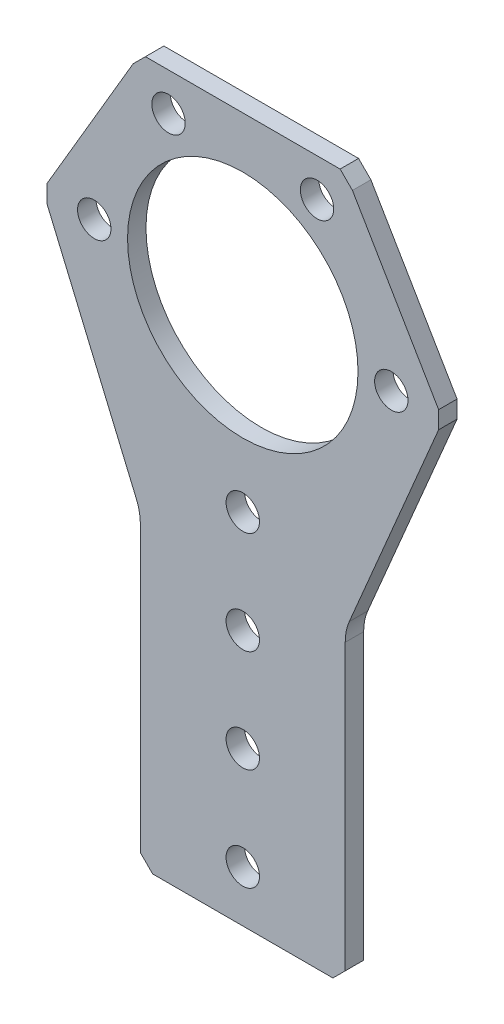
ISO-10303-21;
HEADER;
FILE_DESCRIPTION(('STEP AP214'),'2;1');
FILE_NAME('part.step','',(''),(''),'','','');
FILE_SCHEMA(('AUTOMOTIVE_DESIGN { 1 0 10303 214 1 1 1 1 }'));
ENDSEC;
DATA;
#1=APPLICATION_CONTEXT('core data for automotive mechanical design processes');
#2=APPLICATION_PROTOCOL_DEFINITION('international standard','automotive_design',2000,#1);
#3=PRODUCT_CONTEXT('',#1,'mechanical');
#4=PRODUCT('Part','Part','',(#3));
#5=PRODUCT_RELATED_PRODUCT_CATEGORY('part','',(#4));
#6=PRODUCT_DEFINITION_FORMATION('','',#4);
#7=PRODUCT_DEFINITION_CONTEXT('part definition',#1,'design');
#8=PRODUCT_DEFINITION('design','',#6,#7);
#9=PRODUCT_DEFINITION_SHAPE('','',#8);
#10=(LENGTH_UNIT() NAMED_UNIT(*) SI_UNIT(.MILLI.,.METRE.));
#11=(NAMED_UNIT(*) PLANE_ANGLE_UNIT() SI_UNIT($,.RADIAN.));
#12=(NAMED_UNIT(*) SI_UNIT($,.STERADIAN.) SOLID_ANGLE_UNIT());
#13=UNCERTAINTY_MEASURE_WITH_UNIT(LENGTH_MEASURE(1.E-05),#10,'distance_accuracy_value','');
#14=(GEOMETRIC_REPRESENTATION_CONTEXT(3) GLOBAL_UNCERTAINTY_ASSIGNED_CONTEXT((#13)) GLOBAL_UNIT_ASSIGNED_CONTEXT((#10,
#11,#12)) REPRESENTATION_CONTEXT('',''));
#15=CARTESIAN_POINT('',(0.,0.,0.));
#16=DIRECTION('',(0.,0.,1.));
#17=DIRECTION('',(1.,0.,0.));
#18=AXIS2_PLACEMENT_3D('',#15,#16,#17);
#19=CARTESIAN_POINT('',(12.7,20.6375,2.286));
#20=DIRECTION('',(0.,0.,1.));
#21=DIRECTION('',(1.,0.,0.));
#22=AXIS2_PLACEMENT_3D('',#19,#20,#21);
#23=PLANE('',#22);
#24=DIRECTION('',(-0.390299848982142,0.920687801529116,0.));
#25=VECTOR('',#24,1.);
#26=CARTESIAN_POINT('',(-12.7,-28.575,2.286));
#27=LINE('',#26,#25);
#28=CARTESIAN_POINT('',(-24.2821380930031,-1.25361290322579,2.286));
#29=VERTEX_POINT('',#28);
#30=CARTESIAN_POINT('',(-13.2036324602901,-27.3869691466639,2.286));
#31=VERTEX_POINT('',#30);
#32=EDGE_CURVE('E201',#29,#31,#27,.F.);
#33=ORIENTED_EDGE('',*,*,#32,.T.);
#34=CARTESIAN_POINT('',(-19.05,-29.8653731877005,2.286));
#35=DIRECTION('',(0.,0.,1.));
#36=DIRECTION('',(1.,0.,0.));
#37=AXIS2_PLACEMENT_3D('',#34,#35,#36);
#38=CIRCLE('',#37,6.35);
#39=CARTESIAN_POINT('',(-12.7,-29.8653731877005,2.286));
#40=VERTEX_POINT('',#39);
#41=EDGE_CURVE('E280',#31,#40,#38,.F.);
#42=ORIENTED_EDGE('',*,*,#41,.T.);
#43=DIRECTION('',(0.,1.,0.));
#44=VECTOR('',#43,1.);
#45=CARTESIAN_POINT('',(-12.7,-28.575,2.286));
#46=LINE('',#45,#44);
#47=CARTESIAN_POINT('',(-12.7,-65.1483564594183,2.286));
#48=VERTEX_POINT('',#47);
#49=EDGE_CURVE('E193',#40,#48,#46,.F.);
#50=ORIENTED_EDGE('',*,*,#49,.T.);
#51=DIRECTION('',(0.707106781186555,-0.70710678118654,0.));
#52=VECTOR('',#51,1.);
#53=CARTESIAN_POINT('',(-38.924178229709,-38.9241782297099,2.286));
#54=LINE('',#53,#52);
#55=CARTESIAN_POINT('',(-11.1733564594182,-66.675,2.286));
#56=VERTEX_POINT('',#55);
#57=EDGE_CURVE('E191',#56,#48,#54,.F.);
#58=ORIENTED_EDGE('',*,*,#57,.F.);
#59=DIRECTION('',(1.,0.,0.));
#60=VECTOR('',#59,1.);
#61=CARTESIAN_POINT('',(-12.7,-66.675,2.286));
#62=LINE('',#61,#60);
#63=CARTESIAN_POINT('',(11.1733564594183,-66.675,2.286));
#64=VERTEX_POINT('',#63);
#65=EDGE_CURVE('E185',#56,#64,#62,.T.);
#66=ORIENTED_EDGE('',*,*,#65,.T.);
#67=DIRECTION('',(0.70710678118654,0.707106781186555,0.));
#68=VECTOR('',#67,1.);
#69=CARTESIAN_POINT('',(38.9241782297093,-38.9241782297084,2.286));
#70=LINE('',#69,#68);
#71=CARTESIAN_POINT('',(12.7,-65.1483564594182,2.286));
#72=VERTEX_POINT('',#71);
#73=EDGE_CURVE('E171',#72,#64,#70,.F.);
#74=ORIENTED_EDGE('',*,*,#73,.F.);
#75=DIRECTION('',(0.,-1.,0.));
#76=VECTOR('',#75,1.);
#77=CARTESIAN_POINT('',(12.7,-28.575,2.286));
#78=LINE('',#77,#76);
#79=CARTESIAN_POINT('',(12.7,-29.8653731877005,2.286));
#80=VERTEX_POINT('',#79);
#81=EDGE_CURVE('E125',#72,#80,#78,.F.);
#82=ORIENTED_EDGE('',*,*,#81,.T.);
#83=CARTESIAN_POINT('',(19.05,-29.8653731877005,2.286));
#84=DIRECTION('',(0.,0.,1.));
#85=DIRECTION('',(1.,0.,0.));
#86=AXIS2_PLACEMENT_3D('',#83,#84,#85);
#87=CIRCLE('',#86,6.35);
#88=CARTESIAN_POINT('',(13.2036324602901,-27.3869691466639,2.286));
#89=VERTEX_POINT('',#88);
#90=EDGE_CURVE('E128',#80,#89,#87,.F.);
#91=ORIENTED_EDGE('',*,*,#90,.T.);
#92=DIRECTION('',(-0.390299848982142,-0.920687801529116,0.));
#93=VECTOR('',#92,1.);
#94=CARTESIAN_POINT('',(24.8135722295241,0.,2.286));
#95=LINE('',#94,#93);
#96=CARTESIAN_POINT('',(24.282138093003,-1.25361290322581,2.286));
#97=VERTEX_POINT('',#96);
#98=EDGE_CURVE('E132',#89,#97,#95,.F.);
#99=ORIENTED_EDGE('',*,*,#98,.T.);
#100=DIRECTION('',(0.,1.,0.));
#101=VECTOR('',#100,1.);
#102=CARTESIAN_POINT('',(24.2821380930031,0.,2.286));
#103=LINE('',#102,#101);
#104=CARTESIAN_POINT('',(24.2821380930031,0.905387096774183,2.286));
#105=VERTEX_POINT('',#104);
#106=EDGE_CURVE('E145',#105,#97,#103,.F.);
#107=ORIENTED_EDGE('',*,*,#106,.F.);
#108=DIRECTION('',(0.506208556856748,-0.862411095107785,0.));
#109=VECTOR('',#108,1.);
#110=CARTESIAN_POINT('',(12.7,20.6375,2.286));
#111=LINE('',#110,#109);
#112=CARTESIAN_POINT('',(13.5960923947946,19.1108564594183,2.286));
#113=VERTEX_POINT('',#112);
#114=EDGE_CURVE('E233',#105,#113,#111,.F.);
#115=ORIENTED_EDGE('',*,*,#114,.T.);
#116=DIRECTION('',(-0.707106781186557,0.707106781186538,0.));
#117=VECTOR('',#116,1.);
#118=CARTESIAN_POINT('',(16.3534744271062,16.3534744271067,2.286));
#119=LINE('',#118,#117);
#120=CARTESIAN_POINT('',(12.0694488542128,20.6375,2.286));
#121=VERTEX_POINT('',#120);
#122=EDGE_CURVE('E228',#121,#113,#119,.F.);
#123=ORIENTED_EDGE('',*,*,#122,.F.);
#124=DIRECTION('',(1.,0.,0.));
#125=VECTOR('',#124,1.);
#126=CARTESIAN_POINT('',(-12.7,20.6375,2.286));
#127=LINE('',#126,#125);
#128=CARTESIAN_POINT('',(-12.0694488542129,20.6375,2.286));
#129=VERTEX_POINT('',#128);
#130=EDGE_CURVE('E222',#121,#129,#127,.F.);
#131=ORIENTED_EDGE('',*,*,#130,.T.);
#132=DIRECTION('',(0.70710678118654,0.707106781186555,0.));
#133=VECTOR('',#132,1.);
#134=CARTESIAN_POINT('',(-16.3534744271066,16.3534744271062,2.286));
#135=LINE('',#134,#133);
#136=CARTESIAN_POINT('',(-13.5960923947946,19.1108564594182,2.286));
#137=VERTEX_POINT('',#136);
#138=EDGE_CURVE('E217',#129,#137,#135,.F.);
#139=ORIENTED_EDGE('',*,*,#138,.T.);
#140=DIRECTION('',(0.506208556856748,0.862411095107785,0.));
#141=VECTOR('',#140,1.);
#142=CARTESIAN_POINT('',(-24.8135722295241,0.,2.286));
#143=LINE('',#142,#141);
#144=CARTESIAN_POINT('',(-24.2821380930031,0.905387096774195,2.286));
#145=VERTEX_POINT('',#144);
#146=EDGE_CURVE('E209',#137,#145,#143,.F.);
#147=ORIENTED_EDGE('',*,*,#146,.T.);
#148=DIRECTION('',(0.,1.,0.));
#149=VECTOR('',#148,1.);
#150=CARTESIAN_POINT('',(-24.2821380930031,0.,2.286));
#151=LINE('',#150,#149);
#152=EDGE_CURVE('E207',#29,#145,#151,.T.);
#153=ORIENTED_EDGE('',*,*,#152,.F.);
#154=EDGE_LOOP('',(#33,#42,#50,#58,#66,#74,#82,#91,#99,#107,#115,#123,#131,#139,#147,#153));
#155=FACE_BOUND('',#154,.T.);
#156=CARTESIAN_POINT('',(-9.20749999999996,15.9478578106905,2.286));
#157=DIRECTION('',(0.,0.,-1.));
#158=DIRECTION('',(-1.,0.,0.));
#159=AXIS2_PLACEMENT_3D('',#156,#157,#158);
#160=CIRCLE('',#159,2.0701);
#161=CARTESIAN_POINT('',(-11.2776,15.9478578106905,2.286));
#162=VERTEX_POINT('',#161);
#163=EDGE_CURVE('E188',#162,#162,#160,.T.);
#164=ORIENTED_EDGE('',*,*,#163,.T.);
#165=EDGE_LOOP('',(#164));
#166=FACE_BOUND('',#165,.T.);
#167=CARTESIAN_POINT('',(-18.415,0.,2.286));
#168=DIRECTION('',(0.,0.,-1.));
#169=DIRECTION('',(-1.,0.,0.));
#170=AXIS2_PLACEMENT_3D('',#167,#168,#169);
#171=CIRCLE('',#170,2.0701);
#172=CARTESIAN_POINT('',(-20.4851,0.,2.286));
#173=VERTEX_POINT('',#172);
#174=EDGE_CURVE('E285',#173,#173,#171,.T.);
#175=ORIENTED_EDGE('',*,*,#174,.T.);
#176=EDGE_LOOP('',(#175));
#177=FACE_BOUND('',#176,.T.);
#178=CARTESIAN_POINT('',(2.66050878019847E-13,-47.625,2.286));
#179=DIRECTION('',(0.,0.,-1.));
#180=DIRECTION('',(-1.,0.,0.));
#181=AXIS2_PLACEMENT_3D('',#178,#179,#180);
#182=CIRCLE('',#181,2.0701);
#183=CARTESIAN_POINT('',(-2.07009999999973,-47.625,2.286));
#184=VERTEX_POINT('',#183);
#185=EDGE_CURVE('E288',#184,#184,#182,.T.);
#186=ORIENTED_EDGE('',*,*,#185,.T.);
#187=EDGE_LOOP('',(#186));
#188=FACE_BOUND('',#187,.T.);
#189=CARTESIAN_POINT('',(0.,-22.225,2.286));
#190=DIRECTION('',(0.,0.,-1.));
#191=DIRECTION('',(-1.,0.,0.));
#192=AXIS2_PLACEMENT_3D('',#189,#190,#191);
#193=CIRCLE('',#192,2.0701);
#194=CARTESIAN_POINT('',(-2.0701,-22.225,2.286));
#195=VERTEX_POINT('',#194);
#196=EDGE_CURVE('E291',#195,#195,#193,.T.);
#197=ORIENTED_EDGE('',*,*,#196,.T.);
#198=EDGE_LOOP('',(#197));
#199=FACE_BOUND('',#198,.T.);
#200=CARTESIAN_POINT('',(0.,0.,2.286));
#201=DIRECTION('',(0.,0.,-1.));
#202=DIRECTION('',(-1.,0.,0.));
#203=AXIS2_PLACEMENT_3D('',#200,#201,#202);
#204=CIRCLE('',#203,14.2875);
#205=CARTESIAN_POINT('',(-14.2875,0.,2.286));
#206=VERTEX_POINT('',#205);
#207=EDGE_CURVE('E294',#206,#206,#204,.T.);
#208=ORIENTED_EDGE('',*,*,#207,.T.);
#209=EDGE_LOOP('',(#208));
#210=FACE_BOUND('',#209,.T.);
#211=CARTESIAN_POINT('',(1.33025439009923E-13,-34.925,2.286));
#212=DIRECTION('',(0.,0.,-1.));
#213=DIRECTION('',(-1.,0.,0.));
#214=AXIS2_PLACEMENT_3D('',#211,#212,#213);
#215=CIRCLE('',#214,2.0701);
#216=CARTESIAN_POINT('',(-2.07009999999987,-34.925,2.286));
#217=VERTEX_POINT('',#216);
#218=EDGE_CURVE('E297',#217,#217,#215,.T.);
#219=ORIENTED_EDGE('',*,*,#218,.T.);
#220=EDGE_LOOP('',(#219));
#221=FACE_BOUND('',#220,.T.);
#222=CARTESIAN_POINT('',(3.9907631702977E-13,-60.325,2.286));
#223=DIRECTION('',(0.,0.,-1.));
#224=DIRECTION('',(-1.,0.,0.));
#225=AXIS2_PLACEMENT_3D('',#222,#223,#224);
#226=CIRCLE('',#225,2.0701);
#227=CARTESIAN_POINT('',(-2.0700999999996,-60.325,2.286));
#228=VERTEX_POINT('',#227);
#229=EDGE_CURVE('E300',#228,#228,#226,.T.);
#230=ORIENTED_EDGE('',*,*,#229,.T.);
#231=EDGE_LOOP('',(#230));
#232=FACE_BOUND('',#231,.T.);
#233=CARTESIAN_POINT('',(18.415,0.,2.286));
#234=DIRECTION('',(0.,0.,-1.));
#235=DIRECTION('',(-1.,0.,0.));
#236=AXIS2_PLACEMENT_3D('',#233,#234,#235);
#237=CIRCLE('',#236,2.0701);
#238=CARTESIAN_POINT('',(16.3449,0.,2.286));
#239=VERTEX_POINT('',#238);
#240=EDGE_CURVE('E302',#239,#239,#237,.T.);
#241=ORIENTED_EDGE('',*,*,#240,.T.);
#242=EDGE_LOOP('',(#241));
#243=FACE_BOUND('',#242,.T.);
#244=CARTESIAN_POINT('',(9.20750000000008,15.9478578106904,2.286));
#245=DIRECTION('',(0.,0.,-1.));
#246=DIRECTION('',(-1.,0.,0.));
#247=AXIS2_PLACEMENT_3D('',#244,#245,#246);
#248=CIRCLE('',#247,2.0701);
#249=CARTESIAN_POINT('',(7.13740000000008,15.9478578106904,2.286));
#250=VERTEX_POINT('',#249);
#251=EDGE_CURVE('E20',#250,#250,#248,.T.);
#252=ORIENTED_EDGE('',*,*,#251,.T.);
#253=EDGE_LOOP('',(#252));
#254=FACE_BOUND('',#253,.T.);
#255=ADVANCED_FACE('F17',(#155,#166,#177,#188,#199,#210,#221,#232,#243,#254),#23,.T.);
#256=CARTESIAN_POINT('',(9.20750000000008,15.9478578106904,2.286));
#257=DIRECTION('',(0.,0.,-1.));
#258=DIRECTION('',(-1.,0.,0.));
#259=AXIS2_PLACEMENT_3D('',#256,#257,#258);
#260=CYLINDRICAL_SURFACE('',#259,2.0701);
#261=CARTESIAN_POINT('',(9.20750000000008,15.9478578106904,0.));
#262=DIRECTION('',(0.,0.,-1.));
#263=DIRECTION('',(-1.,0.,0.));
#264=AXIS2_PLACEMENT_3D('',#261,#262,#263);
#265=CIRCLE('',#264,2.0701);
#266=CARTESIAN_POINT('',(7.13740000000008,15.9478578106904,0.));
#267=VERTEX_POINT('',#266);
#268=EDGE_CURVE('E182',#267,#267,#265,.T.);
#269=ORIENTED_EDGE('',*,*,#268,.T.);
#270=EDGE_LOOP('',(#269));
#271=FACE_BOUND('',#270,.T.);
#272=ORIENTED_EDGE('',*,*,#251,.F.);
#273=EDGE_LOOP('',(#272));
#274=FACE_BOUND('',#273,.T.);
#275=ADVANCED_FACE('F310',(#271,#274),#260,.F.);
#276=CARTESIAN_POINT('',(18.415,0.,2.286));
#277=DIRECTION('',(0.,0.,-1.));
#278=DIRECTION('',(-1.,0.,0.));
#279=AXIS2_PLACEMENT_3D('',#276,#277,#278);
#280=CYLINDRICAL_SURFACE('',#279,2.0701);
#281=CARTESIAN_POINT('',(18.415,0.,0.));
#282=DIRECTION('',(0.,0.,-1.));
#283=DIRECTION('',(-1.,0.,0.));
#284=AXIS2_PLACEMENT_3D('',#281,#282,#283);
#285=CIRCLE('',#284,2.0701);
#286=CARTESIAN_POINT('',(16.3449,0.,0.));
#287=VERTEX_POINT('',#286);
#288=EDGE_CURVE('E275',#287,#287,#285,.T.);
#289=ORIENTED_EDGE('',*,*,#288,.T.);
#290=EDGE_LOOP('',(#289));
#291=FACE_BOUND('',#290,.T.);
#292=ORIENTED_EDGE('',*,*,#240,.F.);
#293=EDGE_LOOP('',(#292));
#294=FACE_BOUND('',#293,.T.);
#295=ADVANCED_FACE('F312',(#291,#294),#280,.F.);
#296=CARTESIAN_POINT('',(3.9907631702977E-13,-60.325,2.286));
#297=DIRECTION('',(0.,0.,-1.));
#298=DIRECTION('',(-1.,0.,0.));
#299=AXIS2_PLACEMENT_3D('',#296,#297,#298);
#300=CYLINDRICAL_SURFACE('',#299,2.0701);
#301=CARTESIAN_POINT('',(3.9907631702977E-13,-60.325,0.));
#302=DIRECTION('',(0.,0.,-1.));
#303=DIRECTION('',(-1.,0.,0.));
#304=AXIS2_PLACEMENT_3D('',#301,#302,#303);
#305=CIRCLE('',#304,2.0701);
#306=CARTESIAN_POINT('',(-2.0700999999996,-60.325,0.));
#307=VERTEX_POINT('',#306);
#308=EDGE_CURVE('E272',#307,#307,#305,.T.);
#309=ORIENTED_EDGE('',*,*,#308,.T.);
#310=EDGE_LOOP('',(#309));
#311=FACE_BOUND('',#310,.T.);
#312=ORIENTED_EDGE('',*,*,#229,.F.);
#313=EDGE_LOOP('',(#312));
#314=FACE_BOUND('',#313,.T.);
#315=ADVANCED_FACE('F319',(#311,#314),#300,.F.);
#316=CARTESIAN_POINT('',(1.33025439009923E-13,-34.925,2.286));
#317=DIRECTION('',(0.,0.,-1.));
#318=DIRECTION('',(-1.,0.,0.));
#319=AXIS2_PLACEMENT_3D('',#316,#317,#318);
#320=CYLINDRICAL_SURFACE('',#319,2.0701);
#321=CARTESIAN_POINT('',(1.33025439009923E-13,-34.925,0.));
#322=DIRECTION('',(0.,0.,-1.));
#323=DIRECTION('',(-1.,0.,0.));
#324=AXIS2_PLACEMENT_3D('',#321,#322,#323);
#325=CIRCLE('',#324,2.0701);
#326=CARTESIAN_POINT('',(-2.07009999999987,-34.925,0.));
#327=VERTEX_POINT('',#326);
#328=EDGE_CURVE('E269',#327,#327,#325,.T.);
#329=ORIENTED_EDGE('',*,*,#328,.T.);
#330=EDGE_LOOP('',(#329));
#331=FACE_BOUND('',#330,.T.);
#332=ORIENTED_EDGE('',*,*,#218,.F.);
#333=EDGE_LOOP('',(#332));
#334=FACE_BOUND('',#333,.T.);
#335=ADVANCED_FACE('F409',(#331,#334),#320,.F.);
#336=CARTESIAN_POINT('',(0.,0.,2.286));
#337=DIRECTION('',(0.,0.,-1.));
#338=DIRECTION('',(-1.,0.,0.));
#339=AXIS2_PLACEMENT_3D('',#336,#337,#338);
#340=CYLINDRICAL_SURFACE('',#339,14.2875);
#341=CARTESIAN_POINT('',(0.,0.,0.));
#342=DIRECTION('',(0.,0.,-1.));
#343=DIRECTION('',(-1.,0.,0.));
#344=AXIS2_PLACEMENT_3D('',#341,#342,#343);
#345=CIRCLE('',#344,14.2875);
#346=CARTESIAN_POINT('',(-14.2875,0.,0.));
#347=VERTEX_POINT('',#346);
#348=EDGE_CURVE('E266',#347,#347,#345,.T.);
#349=ORIENTED_EDGE('',*,*,#348,.T.);
#350=EDGE_LOOP('',(#349));
#351=FACE_BOUND('',#350,.T.);
#352=ORIENTED_EDGE('',*,*,#207,.F.);
#353=EDGE_LOOP('',(#352));
#354=FACE_BOUND('',#353,.T.);
#355=ADVANCED_FACE('F405',(#351,#354),#340,.F.);
#356=CARTESIAN_POINT('',(0.,-22.225,2.286));
#357=DIRECTION('',(0.,0.,-1.));
#358=DIRECTION('',(-1.,0.,0.));
#359=AXIS2_PLACEMENT_3D('',#356,#357,#358);
#360=CYLINDRICAL_SURFACE('',#359,2.0701);
#361=CARTESIAN_POINT('',(0.,-22.225,0.));
#362=DIRECTION('',(0.,0.,-1.));
#363=DIRECTION('',(-1.,0.,0.));
#364=AXIS2_PLACEMENT_3D('',#361,#362,#363);
#365=CIRCLE('',#364,2.0701);
#366=CARTESIAN_POINT('',(-2.0701,-22.225,0.));
#367=VERTEX_POINT('',#366);
#368=EDGE_CURVE('E263',#367,#367,#365,.T.);
#369=ORIENTED_EDGE('',*,*,#368,.T.);
#370=EDGE_LOOP('',(#369));
#371=FACE_BOUND('',#370,.T.);
#372=ORIENTED_EDGE('',*,*,#196,.F.);
#373=EDGE_LOOP('',(#372));
#374=FACE_BOUND('',#373,.T.);
#375=ADVANCED_FACE('F401',(#371,#374),#360,.F.);
#376=CARTESIAN_POINT('',(2.66050878019847E-13,-47.625,2.286));
#377=DIRECTION('',(0.,0.,-1.));
#378=DIRECTION('',(-1.,0.,0.));
#379=AXIS2_PLACEMENT_3D('',#376,#377,#378);
#380=CYLINDRICAL_SURFACE('',#379,2.0701);
#381=CARTESIAN_POINT('',(2.66050878019847E-13,-47.625,0.));
#382=DIRECTION('',(0.,0.,-1.));
#383=DIRECTION('',(-1.,0.,0.));
#384=AXIS2_PLACEMENT_3D('',#381,#382,#383);
#385=CIRCLE('',#384,2.0701);
#386=CARTESIAN_POINT('',(-2.07009999999973,-47.625,0.));
#387=VERTEX_POINT('',#386);
#388=EDGE_CURVE('E260',#387,#387,#385,.T.);
#389=ORIENTED_EDGE('',*,*,#388,.T.);
#390=EDGE_LOOP('',(#389));
#391=FACE_BOUND('',#390,.T.);
#392=ORIENTED_EDGE('',*,*,#185,.F.);
#393=EDGE_LOOP('',(#392));
#394=FACE_BOUND('',#393,.T.);
#395=ADVANCED_FACE('F397',(#391,#394),#380,.F.);
#396=CARTESIAN_POINT('',(-18.415,0.,2.286));
#397=DIRECTION('',(0.,0.,-1.));
#398=DIRECTION('',(-1.,0.,0.));
#399=AXIS2_PLACEMENT_3D('',#396,#397,#398);
#400=CYLINDRICAL_SURFACE('',#399,2.0701);
#401=CARTESIAN_POINT('',(-18.415,0.,0.));
#402=DIRECTION('',(0.,0.,-1.));
#403=DIRECTION('',(-1.,0.,0.));
#404=AXIS2_PLACEMENT_3D('',#401,#402,#403);
#405=CIRCLE('',#404,2.0701);
#406=CARTESIAN_POINT('',(-20.4851,0.,0.));
#407=VERTEX_POINT('',#406);
#408=EDGE_CURVE('E257',#407,#407,#405,.T.);
#409=ORIENTED_EDGE('',*,*,#408,.T.);
#410=EDGE_LOOP('',(#409));
#411=FACE_BOUND('',#410,.T.);
#412=ORIENTED_EDGE('',*,*,#174,.F.);
#413=EDGE_LOOP('',(#412));
#414=FACE_BOUND('',#413,.T.);
#415=ADVANCED_FACE('F393',(#411,#414),#400,.F.);
#416=CARTESIAN_POINT('',(-9.20749999999996,15.9478578106905,2.286));
#417=DIRECTION('',(0.,0.,-1.));
#418=DIRECTION('',(-1.,0.,0.));
#419=AXIS2_PLACEMENT_3D('',#416,#417,#418);
#420=CYLINDRICAL_SURFACE('',#419,2.0701);
#421=CARTESIAN_POINT('',(-9.20749999999996,15.9478578106905,0.));
#422=DIRECTION('',(0.,0.,-1.));
#423=DIRECTION('',(-1.,0.,0.));
#424=AXIS2_PLACEMENT_3D('',#421,#422,#423);
#425=CIRCLE('',#424,2.0701);
#426=CARTESIAN_POINT('',(-11.2776,15.9478578106905,0.));
#427=VERTEX_POINT('',#426);
#428=EDGE_CURVE('E176',#427,#427,#425,.T.);
#429=ORIENTED_EDGE('',*,*,#428,.T.);
#430=EDGE_LOOP('',(#429));
#431=FACE_BOUND('',#430,.T.);
#432=ORIENTED_EDGE('',*,*,#163,.F.);
#433=EDGE_LOOP('',(#432));
#434=FACE_BOUND('',#433,.T.);
#435=ADVANCED_FACE('F389',(#431,#434),#420,.F.);
#436=CARTESIAN_POINT('',(-12.7,-66.675,2.286));
#437=DIRECTION('',(0.,1.,0.));
#438=DIRECTION('',(0.,0.,1.));
#439=AXIS2_PLACEMENT_3D('',#436,#437,#438);
#440=PLANE('',#439);
#441=DIRECTION('',(1.,0.,0.));
#442=VECTOR('',#441,1.);
#443=CARTESIAN_POINT('',(12.7,-66.675,0.));
#444=LINE('',#443,#442);
#445=CARTESIAN_POINT('',(-11.1733564594182,-66.675,0.));
#446=VERTEX_POINT('',#445);
#447=CARTESIAN_POINT('',(11.1733564594183,-66.675,0.));
#448=VERTEX_POINT('',#447);
#449=EDGE_CURVE('E166',#446,#448,#444,.T.);
#450=ORIENTED_EDGE('',*,*,#449,.T.);
#451=DIRECTION('',(0.,0.,1.));
#452=VECTOR('',#451,1.);
#453=CARTESIAN_POINT('',(11.1733564594183,-66.675,0.));
#454=LINE('',#453,#452);
#455=EDGE_CURVE('E169',#64,#448,#454,.F.);
#456=ORIENTED_EDGE('',*,*,#455,.F.);
#457=ORIENTED_EDGE('',*,*,#65,.F.);
#458=DIRECTION('',(0.,0.,1.));
#459=VECTOR('',#458,1.);
#460=CARTESIAN_POINT('',(-11.1733564594182,-66.675,0.));
#461=LINE('',#460,#459);
#462=EDGE_CURVE('E179',#446,#56,#461,.T.);
#463=ORIENTED_EDGE('',*,*,#462,.F.);
#464=EDGE_LOOP('',(#450,#456,#457,#463));
#465=FACE_BOUND('',#464,.T.);
#466=ADVANCED_FACE('F385',(#465),#440,.F.);
#467=CARTESIAN_POINT('',(38.9241782297093,-38.9241782297084,0.));
#468=DIRECTION('',(0.707106781186555,-0.70710678118654,0.));
#469=DIRECTION('',(0.70710678118654,0.707106781186555,0.));
#470=AXIS2_PLACEMENT_3D('',#467,#468,#469);
#471=PLANE('',#470);
#472=DIRECTION('',(0.70710678118654,0.707106781186556,0.));
#473=VECTOR('',#472,1.);
#474=CARTESIAN_POINT('',(11.1733564594183,-66.675,0.));
#475=LINE('',#474,#473);
#476=CARTESIAN_POINT('',(12.7,-65.1483564594182,0.));
#477=VERTEX_POINT('',#476);
#478=EDGE_CURVE('E162',#448,#477,#475,.T.);
#479=ORIENTED_EDGE('',*,*,#478,.T.);
#480=DIRECTION('',(0.,0.,1.));
#481=VECTOR('',#480,1.);
#482=CARTESIAN_POINT('',(12.7,-65.1483564594182,2.286));
#483=LINE('',#482,#481);
#484=EDGE_CURVE('E157',#477,#72,#483,.T.);
#485=ORIENTED_EDGE('',*,*,#484,.T.);
#486=ORIENTED_EDGE('',*,*,#73,.T.);
#487=ORIENTED_EDGE('',*,*,#455,.T.);
#488=EDGE_LOOP('',(#479,#485,#486,#487));
#489=FACE_BOUND('',#488,.T.);
#490=ADVANCED_FACE('F381',(#489),#471,.T.);
#491=CARTESIAN_POINT('',(12.7,-28.575,2.286));
#492=DIRECTION('',(-1.,0.,0.));
#493=DIRECTION('',(0.,-1.,0.));
#494=AXIS2_PLACEMENT_3D('',#491,#492,#493);
#495=PLANE('',#494);
#496=DIRECTION('',(0.,1.,0.));
#497=VECTOR('',#496,1.);
#498=CARTESIAN_POINT('',(12.7,20.6375,0.));
#499=LINE('',#498,#497);
#500=CARTESIAN_POINT('',(12.7,-29.8653731877005,0.));
#501=VERTEX_POINT('',#500);
#502=EDGE_CURVE('E165',#477,#501,#499,.T.);
#503=ORIENTED_EDGE('',*,*,#502,.T.);
#504=DIRECTION('',(0.,0.,1.));
#505=VECTOR('',#504,1.);
#506=CARTESIAN_POINT('',(12.7,-29.8653731877005,2.286));
#507=LINE('',#506,#505);
#508=EDGE_CURVE('E138',#501,#80,#507,.T.);
#509=ORIENTED_EDGE('',*,*,#508,.T.);
#510=ORIENTED_EDGE('',*,*,#81,.F.);
#511=ORIENTED_EDGE('',*,*,#484,.F.);
#512=EDGE_LOOP('',(#503,#509,#510,#511));
#513=FACE_BOUND('',#512,.T.);
#514=ADVANCED_FACE('F378',(#513),#495,.F.);
#515=CARTESIAN_POINT('',(19.05,-29.8653731877005,2.286));
#516=DIRECTION('',(0.,0.,1.));
#517=DIRECTION('',(1.,0.,0.));
#518=AXIS2_PLACEMENT_3D('',#515,#516,#517);
#519=CYLINDRICAL_SURFACE('',#518,6.35);
#520=ORIENTED_EDGE('',*,*,#508,.F.);
#521=CARTESIAN_POINT('',(19.05,-29.8653731877005,0.));
#522=DIRECTION('',(0.,0.,1.));
#523=DIRECTION('',(1.,0.,0.));
#524=AXIS2_PLACEMENT_3D('',#521,#522,#523);
#525=CIRCLE('',#524,6.35);
#526=CARTESIAN_POINT('',(13.2036324602901,-27.3869691466639,0.));
#527=VERTEX_POINT('',#526);
#528=EDGE_CURVE('E150',#501,#527,#525,.F.);
#529=ORIENTED_EDGE('',*,*,#528,.T.);
#530=DIRECTION('',(0.,0.,1.));
#531=VECTOR('',#530,1.);
#532=CARTESIAN_POINT('',(13.2036324602901,-27.3869691466639,2.286));
#533=LINE('',#532,#531);
#534=EDGE_CURVE('E137',#527,#89,#533,.T.);
#535=ORIENTED_EDGE('',*,*,#534,.T.);
#536=ORIENTED_EDGE('',*,*,#90,.F.);
#537=EDGE_LOOP('',(#520,#529,#535,#536));
#538=FACE_BOUND('',#537,.T.);
#539=ADVANCED_FACE('F148',(#538),#519,.F.);
#540=CARTESIAN_POINT('',(24.8135722295241,0.,2.286));
#541=DIRECTION('',(-0.920687801529116,0.390299848982142,0.));
#542=DIRECTION('',(-0.390299848982142,-0.920687801529116,0.));
#543=AXIS2_PLACEMENT_3D('',#540,#541,#542);
#544=PLANE('',#543);
#545=ORIENTED_EDGE('',*,*,#98,.F.);
#546=ORIENTED_EDGE('',*,*,#534,.F.);
#547=DIRECTION('',(0.390299848982142,0.920687801529116,0.));
#548=VECTOR('',#547,1.);
#549=CARTESIAN_POINT('',(13.2036324602901,-27.3869691466639,0.));
#550=LINE('',#549,#548);
#551=CARTESIAN_POINT('',(24.2821380930031,-1.25361290322579,0.));
#552=VERTEX_POINT('',#551);
#553=EDGE_CURVE('E254',#527,#552,#550,.T.);
#554=ORIENTED_EDGE('',*,*,#553,.T.);
#555=DIRECTION('',(0.,0.,-1.));
#556=VECTOR('',#555,1.);
#557=CARTESIAN_POINT('',(24.2821380930031,-1.25361290322581,0.));
#558=LINE('',#557,#556);
#559=EDGE_CURVE('E144',#97,#552,#558,.T.);
#560=ORIENTED_EDGE('',*,*,#559,.F.);
#561=EDGE_LOOP('',(#545,#546,#554,#560));
#562=FACE_BOUND('',#561,.T.);
#563=ADVANCED_FACE('F141',(#562),#544,.F.);
#564=CARTESIAN_POINT('',(24.2821380930031,0.,0.));
#565=DIRECTION('',(1.,0.,0.));
#566=DIRECTION('',(0.,0.,-1.));
#567=AXIS2_PLACEMENT_3D('',#564,#565,#566);
#568=PLANE('',#567);
#569=DIRECTION('',(0.,1.,0.));
#570=VECTOR('',#569,1.);
#571=CARTESIAN_POINT('',(24.2821380930031,20.6375,0.));
#572=LINE('',#571,#570);
#573=CARTESIAN_POINT('',(24.2821380930031,0.905387096774182,0.));
#574=VERTEX_POINT('',#573);
#575=EDGE_CURVE('E691',#552,#574,#572,.T.);
#576=ORIENTED_EDGE('',*,*,#575,.T.);
#577=DIRECTION('',(0.,0.,1.));
#578=VECTOR('',#577,1.);
#579=CARTESIAN_POINT('',(24.2821380930031,0.905387096774183,2.286));
#580=LINE('',#579,#578);
#581=EDGE_CURVE('E230',#574,#105,#580,.T.);
#582=ORIENTED_EDGE('',*,*,#581,.T.);
#583=ORIENTED_EDGE('',*,*,#106,.T.);
#584=ORIENTED_EDGE('',*,*,#559,.T.);
#585=EDGE_LOOP('',(#576,#582,#583,#584));
#586=FACE_BOUND('',#585,.T.);
#587=ADVANCED_FACE('F369',(#586),#568,.T.);
#588=CARTESIAN_POINT('',(12.7,20.6375,2.286));
#589=DIRECTION('',(-0.862411095107785,-0.506208556856748,0.));
#590=DIRECTION('',(0.506208556856748,-0.862411095107785,0.));
#591=AXIS2_PLACEMENT_3D('',#588,#589,#590);
#592=PLANE('',#591);
#593=DIRECTION('',(-0.506208556856748,0.862411095107785,0.));
#594=VECTOR('',#593,1.);
#595=CARTESIAN_POINT('',(24.2821380930031,0.90538709677418,0.));
#596=LINE('',#595,#594);
#597=CARTESIAN_POINT('',(13.5960923947946,19.1108564594183,0.));
#598=VERTEX_POINT('',#597);
#599=EDGE_CURVE('E683',#574,#598,#596,.T.);
#600=ORIENTED_EDGE('',*,*,#599,.T.);
#601=DIRECTION('',(0.,0.,1.));
#602=VECTOR('',#601,1.);
#603=CARTESIAN_POINT('',(13.5960923947946,19.1108564594183,0.));
#604=LINE('',#603,#602);
#605=EDGE_CURVE('E225',#113,#598,#604,.F.);
#606=ORIENTED_EDGE('',*,*,#605,.F.);
#607=ORIENTED_EDGE('',*,*,#114,.F.);
#608=ORIENTED_EDGE('',*,*,#581,.F.);
#609=EDGE_LOOP('',(#600,#606,#607,#608));
#610=FACE_BOUND('',#609,.T.);
#611=ADVANCED_FACE('F365',(#610),#592,.F.);
#612=CARTESIAN_POINT('',(16.3534744271062,16.3534744271067,0.));
#613=DIRECTION('',(0.707106781186538,0.707106781186557,0.));
#614=DIRECTION('',(-0.707106781186557,0.707106781186538,0.));
#615=AXIS2_PLACEMENT_3D('',#612,#613,#614);
#616=PLANE('',#615);
#617=DIRECTION('',(-0.707106781186556,0.707106781186539,0.));
#618=VECTOR('',#617,1.);
#619=CARTESIAN_POINT('',(13.5960923947946,19.1108564594183,0.));
#620=LINE('',#619,#618);
#621=CARTESIAN_POINT('',(12.0694488542128,20.6375,0.));
#622=VERTEX_POINT('',#621);
#623=EDGE_CURVE('E674',#598,#622,#620,.T.);
#624=ORIENTED_EDGE('',*,*,#623,.T.);
#625=DIRECTION('',(0.,0.,1.));
#626=VECTOR('',#625,1.);
#627=CARTESIAN_POINT('',(12.0694488542128,20.6375,2.286));
#628=LINE('',#627,#626);
#629=EDGE_CURVE('E224',#622,#121,#628,.T.);
#630=ORIENTED_EDGE('',*,*,#629,.T.);
#631=ORIENTED_EDGE('',*,*,#122,.T.);
#632=ORIENTED_EDGE('',*,*,#605,.T.);
#633=EDGE_LOOP('',(#624,#630,#631,#632));
#634=FACE_BOUND('',#633,.T.);
#635=ADVANCED_FACE('F361',(#634),#616,.T.);
#636=CARTESIAN_POINT('',(-12.7,20.6375,2.286));
#637=DIRECTION('',(0.,-1.,0.));
#638=DIRECTION('',(1.,0.,0.));
#639=AXIS2_PLACEMENT_3D('',#636,#637,#638);
#640=PLANE('',#639);
#641=DIRECTION('',(1.,0.,0.));
#642=VECTOR('',#641,1.);
#643=CARTESIAN_POINT('',(12.7,20.6375,0.));
#644=LINE('',#643,#642);
#645=CARTESIAN_POINT('',(-12.0694488542129,20.6375,0.));
#646=VERTEX_POINT('',#645);
#647=EDGE_CURVE('E665',#622,#646,#644,.F.);
#648=ORIENTED_EDGE('',*,*,#647,.T.);
#649=DIRECTION('',(0.,0.,1.));
#650=VECTOR('',#649,1.);
#651=CARTESIAN_POINT('',(-12.0694488542129,20.6375,0.));
#652=LINE('',#651,#650);
#653=EDGE_CURVE('E219',#646,#129,#652,.T.);
#654=ORIENTED_EDGE('',*,*,#653,.T.);
#655=ORIENTED_EDGE('',*,*,#130,.F.);
#656=ORIENTED_EDGE('',*,*,#629,.F.);
#657=EDGE_LOOP('',(#648,#654,#655,#656));
#658=FACE_BOUND('',#657,.T.);
#659=ADVANCED_FACE('F357',(#658),#640,.F.);
#660=CARTESIAN_POINT('',(-16.3534744271066,16.3534744271062,0.));
#661=DIRECTION('',(0.707106781186555,-0.70710678118654,0.));
#662=DIRECTION('',(0.70710678118654,0.707106781186555,0.));
#663=AXIS2_PLACEMENT_3D('',#660,#661,#662);
#664=PLANE('',#663);
#665=ORIENTED_EDGE('',*,*,#653,.F.);
#666=DIRECTION('',(-0.707106781186543,-0.707106781186552,0.));
#667=VECTOR('',#666,1.);
#668=CARTESIAN_POINT('',(-12.0694488542129,20.6375,0.));
#669=LINE('',#668,#667);
#670=CARTESIAN_POINT('',(-13.5960923947946,19.1108564594182,0.));
#671=VERTEX_POINT('',#670);
#672=EDGE_CURVE('E656',#646,#671,#669,.T.);
#673=ORIENTED_EDGE('',*,*,#672,.T.);
#674=DIRECTION('',(0.,0.,1.));
#675=VECTOR('',#674,1.);
#676=CARTESIAN_POINT('',(-13.5960923947946,19.1108564594182,2.286));
#677=LINE('',#676,#675);
#678=EDGE_CURVE('E214',#671,#137,#677,.T.);
#679=ORIENTED_EDGE('',*,*,#678,.T.);
#680=ORIENTED_EDGE('',*,*,#138,.F.);
#681=EDGE_LOOP('',(#665,#673,#679,#680));
#682=FACE_BOUND('',#681,.T.);
#683=ADVANCED_FACE('F353',(#682),#664,.F.);
#684=CARTESIAN_POINT('',(-24.8135722295241,0.,2.286));
#685=DIRECTION('',(0.862411095107785,-0.506208556856748,0.));
#686=DIRECTION('',(0.506208556856748,0.862411095107785,0.));
#687=AXIS2_PLACEMENT_3D('',#684,#685,#686);
#688=PLANE('',#687);
#689=ORIENTED_EDGE('',*,*,#146,.F.);
#690=ORIENTED_EDGE('',*,*,#678,.F.);
#691=DIRECTION('',(-0.506208556856748,-0.862411095107785,0.));
#692=VECTOR('',#691,1.);
#693=CARTESIAN_POINT('',(-13.5960923947946,19.1108564594182,0.));
#694=LINE('',#693,#692);
#695=CARTESIAN_POINT('',(-24.2821380930031,0.905387096774195,0.));
#696=VERTEX_POINT('',#695);
#697=EDGE_CURVE('E648',#671,#696,#694,.T.);
#698=ORIENTED_EDGE('',*,*,#697,.T.);
#699=DIRECTION('',(0.,0.,1.));
#700=VECTOR('',#699,1.);
#701=CARTESIAN_POINT('',(-24.2821380930031,0.905387096774195,0.));
#702=LINE('',#701,#700);
#703=EDGE_CURVE('E204',#145,#696,#702,.F.);
#704=ORIENTED_EDGE('',*,*,#703,.F.);
#705=EDGE_LOOP('',(#689,#690,#698,#704));
#706=FACE_BOUND('',#705,.T.);
#707=ADVANCED_FACE('F349',(#706),#688,.F.);
#708=CARTESIAN_POINT('',(-24.2821380930031,0.,0.));
#709=DIRECTION('',(-1.,0.,0.));
#710=DIRECTION('',(0.,0.,1.));
#711=AXIS2_PLACEMENT_3D('',#708,#709,#710);
#712=PLANE('',#711);
#713=DIRECTION('',(0.,1.,0.));
#714=VECTOR('',#713,1.);
#715=CARTESIAN_POINT('',(-24.2821380930031,20.6375,0.));
#716=LINE('',#715,#714);
#717=CARTESIAN_POINT('',(-24.2821380930031,-1.25361290322577,0.));
#718=VERTEX_POINT('',#717);
#719=EDGE_CURVE('E645',#696,#718,#716,.F.);
#720=ORIENTED_EDGE('',*,*,#719,.T.);
#721=DIRECTION('',(0.,0.,1.));
#722=VECTOR('',#721,1.);
#723=CARTESIAN_POINT('',(-24.2821380930031,-1.25361290322579,2.286));
#724=LINE('',#723,#722);
#725=EDGE_CURVE('E203',#718,#29,#724,.T.);
#726=ORIENTED_EDGE('',*,*,#725,.T.);
#727=ORIENTED_EDGE('',*,*,#152,.T.);
#728=ORIENTED_EDGE('',*,*,#703,.T.);
#729=EDGE_LOOP('',(#720,#726,#727,#728));
#730=FACE_BOUND('',#729,.T.);
#731=ADVANCED_FACE('F345',(#730),#712,.T.);
#732=CARTESIAN_POINT('',(-12.7,-28.575,2.286));
#733=DIRECTION('',(0.920687801529116,0.390299848982142,0.));
#734=DIRECTION('',(-0.390299848982142,0.920687801529116,0.));
#735=AXIS2_PLACEMENT_3D('',#732,#733,#734);
#736=PLANE('',#735);
#737=DIRECTION('',(0.390299848982142,-0.920687801529116,0.));
#738=VECTOR('',#737,1.);
#739=CARTESIAN_POINT('',(-24.2821380930031,-1.25361290322579,0.));
#740=LINE('',#739,#738);
#741=CARTESIAN_POINT('',(-13.2036324602901,-27.3869691466639,0.));
#742=VERTEX_POINT('',#741);
#743=EDGE_CURVE('E252',#718,#742,#740,.T.);
#744=ORIENTED_EDGE('',*,*,#743,.T.);
#745=DIRECTION('',(0.,0.,1.));
#746=VECTOR('',#745,1.);
#747=CARTESIAN_POINT('',(-13.2036324602901,-27.3869691466639,2.286));
#748=LINE('',#747,#746);
#749=EDGE_CURVE('E281',#742,#31,#748,.T.);
#750=ORIENTED_EDGE('',*,*,#749,.T.);
#751=ORIENTED_EDGE('',*,*,#32,.F.);
#752=ORIENTED_EDGE('',*,*,#725,.F.);
#753=EDGE_LOOP('',(#744,#750,#751,#752));
#754=FACE_BOUND('',#753,.T.);
#755=ADVANCED_FACE('F341',(#754),#736,.F.);
#756=CARTESIAN_POINT('',(-19.05,-29.8653731877005,2.286));
#757=DIRECTION('',(0.,0.,1.));
#758=DIRECTION('',(1.,0.,0.));
#759=AXIS2_PLACEMENT_3D('',#756,#757,#758);
#760=CYLINDRICAL_SURFACE('',#759,6.35);
#761=ORIENTED_EDGE('',*,*,#749,.F.);
#762=CARTESIAN_POINT('',(-19.05,-29.8653731877005,0.));
#763=DIRECTION('',(0.,0.,1.));
#764=DIRECTION('',(1.,0.,0.));
#765=AXIS2_PLACEMENT_3D('',#762,#763,#764);
#766=CIRCLE('',#765,6.35);
#767=CARTESIAN_POINT('',(-12.7,-29.8653731877005,0.));
#768=VERTEX_POINT('',#767);
#769=EDGE_CURVE('E249',#742,#768,#766,.F.);
#770=ORIENTED_EDGE('',*,*,#769,.T.);
#771=DIRECTION('',(0.,0.,1.));
#772=VECTOR('',#771,1.);
#773=CARTESIAN_POINT('',(-12.7,-29.8653731877005,2.286));
#774=LINE('',#773,#772);
#775=EDGE_CURVE('E198',#768,#40,#774,.T.);
#776=ORIENTED_EDGE('',*,*,#775,.T.);
#777=ORIENTED_EDGE('',*,*,#41,.F.);
#778=EDGE_LOOP('',(#761,#770,#776,#777));
#779=FACE_BOUND('',#778,.T.);
#780=ADVANCED_FACE('F337',(#779),#760,.F.);
#781=CARTESIAN_POINT('',(-12.7,-28.575,2.286));
#782=DIRECTION('',(1.,0.,0.));
#783=DIRECTION('',(0.,1.,0.));
#784=AXIS2_PLACEMENT_3D('',#781,#782,#783);
#785=PLANE('',#784);
#786=ORIENTED_EDGE('',*,*,#49,.F.);
#787=ORIENTED_EDGE('',*,*,#775,.F.);
#788=DIRECTION('',(0.,1.,0.));
#789=VECTOR('',#788,1.);
#790=CARTESIAN_POINT('',(-12.7,20.6375,0.));
#791=LINE('',#790,#789);
#792=CARTESIAN_POINT('',(-12.7,-65.1483564594183,0.));
#793=VERTEX_POINT('',#792);
#794=EDGE_CURVE('E26',#768,#793,#791,.F.);
#795=ORIENTED_EDGE('',*,*,#794,.T.);
#796=DIRECTION('',(0.,0.,1.));
#797=VECTOR('',#796,1.);
#798=CARTESIAN_POINT('',(-12.7,-65.1483564594183,0.));
#799=LINE('',#798,#797);
#800=EDGE_CURVE('E34',#48,#793,#799,.F.);
#801=ORIENTED_EDGE('',*,*,#800,.F.);
#802=EDGE_LOOP('',(#786,#787,#795,#801));
#803=FACE_BOUND('',#802,.T.);
#804=ADVANCED_FACE('F330',(#803),#785,.F.);
#805=CARTESIAN_POINT('',(-38.924178229709,-38.9241782297099,0.));
#806=DIRECTION('',(-0.70710678118654,-0.707106781186555,0.));
#807=DIRECTION('',(0.707106781186555,-0.70710678118654,0.));
#808=AXIS2_PLACEMENT_3D('',#805,#806,#807);
#809=PLANE('',#808);
#810=DIRECTION('',(0.707106781186555,-0.70710678118654,0.));
#811=VECTOR('',#810,1.);
#812=CARTESIAN_POINT('',(-12.7,-65.1483564594183,0.));
#813=LINE('',#812,#811);
#814=EDGE_CURVE('E10',#793,#446,#813,.T.);
#815=ORIENTED_EDGE('',*,*,#814,.T.);
#816=ORIENTED_EDGE('',*,*,#462,.T.);
#817=ORIENTED_EDGE('',*,*,#57,.T.);
#818=ORIENTED_EDGE('',*,*,#800,.T.);
#819=EDGE_LOOP('',(#815,#816,#817,#818));
#820=FACE_BOUND('',#819,.T.);
#821=ADVANCED_FACE('F324',(#820),#809,.T.);
#822=CARTESIAN_POINT('',(12.7,20.6375,0.));
#823=DIRECTION('',(0.,0.,1.));
#824=DIRECTION('',(1.,0.,0.));
#825=AXIS2_PLACEMENT_3D('',#822,#823,#824);
#826=PLANE('',#825);
#827=ORIENTED_EDGE('',*,*,#794,.F.);
#828=ORIENTED_EDGE('',*,*,#769,.F.);
#829=ORIENTED_EDGE('',*,*,#743,.F.);
#830=ORIENTED_EDGE('',*,*,#719,.F.);
#831=ORIENTED_EDGE('',*,*,#697,.F.);
#832=ORIENTED_EDGE('',*,*,#672,.F.);
#833=ORIENTED_EDGE('',*,*,#647,.F.);
#834=ORIENTED_EDGE('',*,*,#623,.F.);
#835=ORIENTED_EDGE('',*,*,#599,.F.);
#836=ORIENTED_EDGE('',*,*,#575,.F.);
#837=ORIENTED_EDGE('',*,*,#553,.F.);
#838=ORIENTED_EDGE('',*,*,#528,.F.);
#839=ORIENTED_EDGE('',*,*,#502,.F.);
#840=ORIENTED_EDGE('',*,*,#478,.F.);
#841=ORIENTED_EDGE('',*,*,#449,.F.);
#842=ORIENTED_EDGE('',*,*,#814,.F.);
#843=EDGE_LOOP('',(#827,#828,#829,#830,#831,#832,#833,#834,#835,#836,#837,#838,#839,#840,#841,#842));
#844=FACE_BOUND('',#843,.T.);
#845=ORIENTED_EDGE('',*,*,#428,.F.);
#846=EDGE_LOOP('',(#845));
#847=FACE_BOUND('',#846,.T.);
#848=ORIENTED_EDGE('',*,*,#408,.F.);
#849=EDGE_LOOP('',(#848));
#850=FACE_BOUND('',#849,.T.);
#851=ORIENTED_EDGE('',*,*,#388,.F.);
#852=EDGE_LOOP('',(#851));
#853=FACE_BOUND('',#852,.T.);
#854=ORIENTED_EDGE('',*,*,#368,.F.);
#855=EDGE_LOOP('',(#854));
#856=FACE_BOUND('',#855,.T.);
#857=ORIENTED_EDGE('',*,*,#348,.F.);
#858=EDGE_LOOP('',(#857));
#859=FACE_BOUND('',#858,.T.);
#860=ORIENTED_EDGE('',*,*,#328,.F.);
#861=EDGE_LOOP('',(#860));
#862=FACE_BOUND('',#861,.T.);
#863=ORIENTED_EDGE('',*,*,#308,.F.);
#864=EDGE_LOOP('',(#863));
#865=FACE_BOUND('',#864,.T.);
#866=ORIENTED_EDGE('',*,*,#288,.F.);
#867=EDGE_LOOP('',(#866));
#868=FACE_BOUND('',#867,.T.);
#869=ORIENTED_EDGE('',*,*,#268,.F.);
#870=EDGE_LOOP('',(#869));
#871=FACE_BOUND('',#870,.T.);
#872=ADVANCED_FACE('F322',(#844,#847,#850,#853,#856,#859,#862,#865,#868,#871),#826,.F.);
#873=CLOSED_SHELL('',(#255,#275,#295,#315,#335,#355,#375,#395,#415,#435,#466,#490,#514,#539,
#563,#587,#611,#635,#659,#683,#707,#731,#755,#780,#804,#821,#872));
#874=MANIFOLD_SOLID_BREP('B1',#873);
#875=ADVANCED_BREP_SHAPE_REPRESENTATION('',(#18,#874),#14);
#876=SHAPE_DEFINITION_REPRESENTATION(#9,#875);
ENDSEC;
END-ISO-10303-21;
